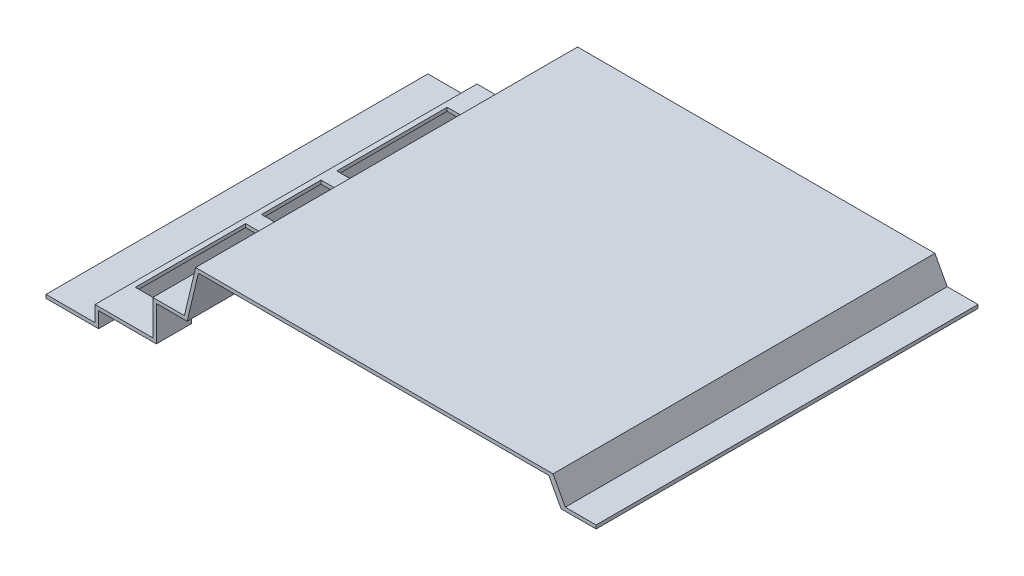
ISO-10303-21;
HEADER;
FILE_DESCRIPTION(('STEP AP214'),'2;1');
FILE_NAME('part.step','',(''),(''),'','','');
FILE_SCHEMA(('AUTOMOTIVE_DESIGN { 1 0 10303 214 1 1 1 1 }'));
ENDSEC;
DATA;
#1=APPLICATION_CONTEXT('core data for automotive mechanical design processes');
#2=APPLICATION_PROTOCOL_DEFINITION('international standard','automotive_design',2000,#1);
#3=PRODUCT_CONTEXT('',#1,'mechanical');
#4=PRODUCT('Part','Part','',(#3));
#5=PRODUCT_RELATED_PRODUCT_CATEGORY('part','',(#4));
#6=PRODUCT_DEFINITION_FORMATION('','',#4);
#7=PRODUCT_DEFINITION_CONTEXT('part definition',#1,'design');
#8=PRODUCT_DEFINITION('design','',#6,#7);
#9=PRODUCT_DEFINITION_SHAPE('','',#8);
#10=(LENGTH_UNIT() NAMED_UNIT(*) SI_UNIT(.MILLI.,.METRE.));
#11=(NAMED_UNIT(*) PLANE_ANGLE_UNIT() SI_UNIT($,.RADIAN.));
#12=(NAMED_UNIT(*) SI_UNIT($,.STERADIAN.) SOLID_ANGLE_UNIT());
#13=UNCERTAINTY_MEASURE_WITH_UNIT(LENGTH_MEASURE(1.E-05),#10,'distance_accuracy_value','');
#14=(GEOMETRIC_REPRESENTATION_CONTEXT(3) GLOBAL_UNCERTAINTY_ASSIGNED_CONTEXT((#13)) GLOBAL_UNIT_ASSIGNED_CONTEXT((#10,
#11,#12)) REPRESENTATION_CONTEXT('',''));
#15=CARTESIAN_POINT('',(0.,0.,0.));
#16=DIRECTION('',(0.,0.,1.));
#17=DIRECTION('',(1.,0.,0.));
#18=AXIS2_PLACEMENT_3D('',#15,#16,#17);
#19=CARTESIAN_POINT('',(63.,29.,109.));
#20=DIRECTION('',(-1.,0.,0.));
#21=DIRECTION('',(0.,0.,1.));
#22=AXIS2_PLACEMENT_3D('',#19,#20,#21);
#23=PLANE('',#22);
#24=DIRECTION('',(0.,0.,-1.));
#25=VECTOR('',#24,1.);
#26=CARTESIAN_POINT('',(63.,29.,109.));
#27=LINE('',#26,#25);
#28=CARTESIAN_POINT('',(63.,29.,-89.));
#29=VERTEX_POINT('',#28);
#30=CARTESIAN_POINT('',(63.,29.,-109.));
#31=VERTEX_POINT('',#30);
#32=EDGE_CURVE('E514',#29,#31,#27,.T.);
#33=ORIENTED_EDGE('',*,*,#32,.F.);
#34=DIRECTION('',(0.,-1.,0.));
#35=VECTOR('',#34,1.);
#36=CARTESIAN_POINT('',(63.,29.,-89.));
#37=LINE('',#36,#35);
#38=CARTESIAN_POINT('',(63.,8.99999999999999,-89.));
#39=VERTEX_POINT('',#38);
#40=EDGE_CURVE('E538',#29,#39,#37,.T.);
#41=ORIENTED_EDGE('',*,*,#40,.T.);
#42=DIRECTION('',(0.,0.,-1.));
#43=VECTOR('',#42,1.);
#44=CARTESIAN_POINT('',(63.,9.,109.));
#45=LINE('',#44,#43);
#46=CARTESIAN_POINT('',(63.,9.,-109.));
#47=VERTEX_POINT('',#46);
#48=EDGE_CURVE('E518',#39,#47,#45,.T.);
#49=ORIENTED_EDGE('',*,*,#48,.T.);
#50=DIRECTION('',(0.,1.,0.));
#51=VECTOR('',#50,1.);
#52=CARTESIAN_POINT('',(63.,29.,-109.));
#53=LINE('',#52,#51);
#54=EDGE_CURVE('E430',#47,#31,#53,.T.);
#55=ORIENTED_EDGE('',*,*,#54,.T.);
#56=EDGE_LOOP('',(#33,#41,#49,#55));
#57=FACE_BOUND('',#56,.T.);
#58=ADVANCED_FACE('F36',(#57),#23,.F.);
#59=CARTESIAN_POINT('',(63.,9.,109.));
#60=VERTEX_POINT('',#59);
#61=CARTESIAN_POINT('',(63.,8.99999999999999,89.));
#62=VERTEX_POINT('',#61);
#63=EDGE_CURVE('E520',#60,#62,#45,.T.);
#64=ORIENTED_EDGE('',*,*,#63,.T.);
#65=DIRECTION('',(0.,1.,0.));
#66=VECTOR('',#65,1.);
#67=CARTESIAN_POINT('',(63.,29.,89.));
#68=LINE('',#67,#66);
#69=CARTESIAN_POINT('',(63.,29.,89.));
#70=VERTEX_POINT('',#69);
#71=EDGE_CURVE('E576',#62,#70,#68,.T.);
#72=ORIENTED_EDGE('',*,*,#71,.T.);
#73=CARTESIAN_POINT('',(63.,29.,109.));
#74=VERTEX_POINT('',#73);
#75=EDGE_CURVE('E515',#74,#70,#27,.T.);
#76=ORIENTED_EDGE('',*,*,#75,.F.);
#77=DIRECTION('',(0.,1.,0.));
#78=VECTOR('',#77,1.);
#79=CARTESIAN_POINT('',(63.,29.,109.));
#80=LINE('',#79,#78);
#81=EDGE_CURVE('E388',#60,#74,#80,.T.);
#82=ORIENTED_EDGE('',*,*,#81,.F.);
#83=EDGE_LOOP('',(#64,#72,#76,#82));
#84=FACE_BOUND('',#83,.T.);
#85=ADVANCED_FACE('F583',(#84),#23,.F.);
#86=CARTESIAN_POINT('',(30.,0.,109.));
#87=DIRECTION('',(0.,1.,0.));
#88=DIRECTION('',(-1.,0.,0.));
#89=AXIS2_PLACEMENT_3D('',#86,#87,#88);
#90=PLANE('',#89);
#91=DIRECTION('',(1.,0.,0.));
#92=VECTOR('',#91,1.);
#93=CARTESIAN_POINT('',(30.,0.,-109.));
#94=LINE('',#93,#92);
#95=CARTESIAN_POINT('',(0.,0.,-109.));
#96=VERTEX_POINT('',#95);
#97=CARTESIAN_POINT('',(30.,0.,-109.));
#98=VERTEX_POINT('',#97);
#99=EDGE_CURVE('E312',#96,#98,#94,.T.);
#100=ORIENTED_EDGE('',*,*,#99,.T.);
#101=DIRECTION('',(0.,0.,-1.));
#102=VECTOR('',#101,1.);
#103=CARTESIAN_POINT('',(30.,0.,109.));
#104=LINE('',#103,#102);
#105=CARTESIAN_POINT('',(30.,0.,109.));
#106=VERTEX_POINT('',#105);
#107=EDGE_CURVE('E11',#106,#98,#104,.T.);
#108=ORIENTED_EDGE('',*,*,#107,.F.);
#109=DIRECTION('',(1.,0.,0.));
#110=VECTOR('',#109,1.);
#111=CARTESIAN_POINT('',(30.,0.,109.));
#112=LINE('',#111,#110);
#113=CARTESIAN_POINT('',(0.,0.,109.));
#114=VERTEX_POINT('',#113);
#115=EDGE_CURVE('E380',#114,#106,#112,.T.);
#116=ORIENTED_EDGE('',*,*,#115,.F.);
#117=DIRECTION('',(0.,0.,-1.));
#118=VECTOR('',#117,1.);
#119=CARTESIAN_POINT('',(0.,0.,109.));
#120=LINE('',#119,#118);
#121=EDGE_CURVE('E422',#114,#96,#120,.T.);
#122=ORIENTED_EDGE('',*,*,#121,.T.);
#123=EDGE_LOOP('',(#100,#108,#116,#122));
#124=FACE_BOUND('',#123,.T.);
#125=ADVANCED_FACE('F38',(#124),#90,.F.);
#126=CARTESIAN_POINT('',(30.,8.99999999999999,109.));
#127=DIRECTION('',(-1.,0.,0.));
#128=DIRECTION('',(0.,-1.,0.));
#129=AXIS2_PLACEMENT_3D('',#126,#127,#128);
#130=PLANE('',#129);
#131=DIRECTION('',(0.,1.,0.));
#132=VECTOR('',#131,1.);
#133=CARTESIAN_POINT('',(30.,8.99999999999999,-109.));
#134=LINE('',#133,#132);
#135=CARTESIAN_POINT('',(30.,8.99999999999999,-109.));
#136=VERTEX_POINT('',#135);
#137=EDGE_CURVE('E425',#98,#136,#134,.T.);
#138=ORIENTED_EDGE('',*,*,#137,.T.);
#139=DIRECTION('',(0.,0.,-1.));
#140=VECTOR('',#139,1.);
#141=CARTESIAN_POINT('',(30.,8.99999999999999,109.));
#142=LINE('',#141,#140);
#143=CARTESIAN_POINT('',(30.,8.99999999999999,109.));
#144=VERTEX_POINT('',#143);
#145=EDGE_CURVE('E44',#144,#136,#142,.T.);
#146=ORIENTED_EDGE('',*,*,#145,.F.);
#147=DIRECTION('',(0.,1.,0.));
#148=VECTOR('',#147,1.);
#149=CARTESIAN_POINT('',(30.,8.99999999999999,109.));
#150=LINE('',#149,#148);
#151=EDGE_CURVE('E383',#106,#144,#150,.T.);
#152=ORIENTED_EDGE('',*,*,#151,.F.);
#153=ORIENTED_EDGE('',*,*,#107,.T.);
#154=EDGE_LOOP('',(#138,#146,#152,#153));
#155=FACE_BOUND('',#154,.T.);
#156=ADVANCED_FACE('F590',(#155),#130,.F.);
#157=CARTESIAN_POINT('',(63.,9.,109.));
#158=DIRECTION('',(0.,1.,0.));
#159=DIRECTION('',(-1.,0.,0.));
#160=AXIS2_PLACEMENT_3D('',#157,#158,#159);
#161=PLANE('',#160);
#162=ORIENTED_EDGE('',*,*,#48,.F.);
#163=DIRECTION('',(1.,0.,0.));
#164=VECTOR('',#163,1.);
#165=CARTESIAN_POINT('',(61.,8.99999999999999,-89.));
#166=LINE('',#165,#164);
#167=CARTESIAN_POINT('',(31.,8.99999999999999,-89.));
#168=VERTEX_POINT('',#167);
#169=EDGE_CURVE('E310',#168,#39,#166,.T.);
#170=ORIENTED_EDGE('',*,*,#169,.F.);
#171=DIRECTION('',(0.,0.,-1.));
#172=VECTOR('',#171,1.);
#173=CARTESIAN_POINT('',(31.,8.99999999999999,-89.));
#174=LINE('',#173,#172);
#175=CARTESIAN_POINT('',(31.,8.99999999999999,-26.));
#176=VERTEX_POINT('',#175);
#177=EDGE_CURVE('E314',#176,#168,#174,.T.);
#178=ORIENTED_EDGE('',*,*,#177,.F.);
#179=DIRECTION('',(-1.,0.,0.));
#180=VECTOR('',#179,1.);
#181=CARTESIAN_POINT('',(61.,8.99999999999999,-26.));
#182=LINE('',#181,#180);
#183=CARTESIAN_POINT('',(61.,8.99999999999999,-26.));
#184=VERTEX_POINT('',#183);
#185=EDGE_CURVE('E309',#184,#176,#182,.T.);
#186=ORIENTED_EDGE('',*,*,#185,.F.);
#187=DIRECTION('',(0.,0.,1.));
#188=VECTOR('',#187,1.);
#189=CARTESIAN_POINT('',(61.,8.99999999999999,-89.));
#190=LINE('',#189,#188);
#191=CARTESIAN_POINT('',(61.,8.99999999999999,-61.));
#192=VERTEX_POINT('',#191);
#193=EDGE_CURVE('E298',#192,#184,#190,.T.);
#194=ORIENTED_EDGE('',*,*,#193,.F.);
#195=DIRECTION('',(-1.,0.,0.));
#196=VECTOR('',#195,1.);
#197=CARTESIAN_POINT('',(64.,8.99999999999999,-61.));
#198=LINE('',#197,#196);
#199=CARTESIAN_POINT('',(63.,8.99999999999999,-61.));
#200=VERTEX_POINT('',#199);
#201=EDGE_CURVE('E281',#200,#192,#198,.T.);
#202=ORIENTED_EDGE('',*,*,#201,.F.);
#203=CARTESIAN_POINT('',(63.,8.99999999999999,61.));
#204=VERTEX_POINT('',#203);
#205=EDGE_CURVE('E522',#204,#200,#45,.T.);
#206=ORIENTED_EDGE('',*,*,#205,.F.);
#207=DIRECTION('',(-1.,0.,0.));
#208=VECTOR('',#207,1.);
#209=CARTESIAN_POINT('',(64.,8.99999999999999,61.));
#210=LINE('',#209,#208);
#211=CARTESIAN_POINT('',(61.,8.99999999999999,61.));
#212=VERTEX_POINT('',#211);
#213=EDGE_CURVE('E548',#204,#212,#210,.T.);
#214=ORIENTED_EDGE('',*,*,#213,.T.);
#215=DIRECTION('',(0.,0.,1.));
#216=VECTOR('',#215,1.);
#217=CARTESIAN_POINT('',(61.,8.99999999999999,26.));
#218=LINE('',#217,#216);
#219=CARTESIAN_POINT('',(61.,8.99999999999999,26.));
#220=VERTEX_POINT('',#219);
#221=EDGE_CURVE('E361',#220,#212,#218,.T.);
#222=ORIENTED_EDGE('',*,*,#221,.F.);
#223=DIRECTION('',(1.,0.,0.));
#224=VECTOR('',#223,1.);
#225=CARTESIAN_POINT('',(61.,8.99999999999999,26.));
#226=LINE('',#225,#224);
#227=CARTESIAN_POINT('',(31.,8.99999999999999,26.));
#228=VERTEX_POINT('',#227);
#229=EDGE_CURVE('E342',#228,#220,#226,.T.);
#230=ORIENTED_EDGE('',*,*,#229,.F.);
#231=DIRECTION('',(0.,0.,-1.));
#232=VECTOR('',#231,1.);
#233=CARTESIAN_POINT('',(31.,8.99999999999999,26.));
#234=LINE('',#233,#232);
#235=CARTESIAN_POINT('',(31.,8.99999999999999,89.));
#236=VERTEX_POINT('',#235);
#237=EDGE_CURVE('E355',#236,#228,#234,.T.);
#238=ORIENTED_EDGE('',*,*,#237,.F.);
#239=DIRECTION('',(-1.,0.,0.));
#240=VECTOR('',#239,1.);
#241=CARTESIAN_POINT('',(61.,8.99999999999999,89.));
#242=LINE('',#241,#240);
#243=EDGE_CURVE('E358',#62,#236,#242,.T.);
#244=ORIENTED_EDGE('',*,*,#243,.F.);
#245=ORIENTED_EDGE('',*,*,#63,.F.);
#246=DIRECTION('',(1.,0.,0.));
#247=VECTOR('',#246,1.);
#248=CARTESIAN_POINT('',(63.,9.,109.));
#249=LINE('',#248,#247);
#250=EDGE_CURVE('E386',#144,#60,#249,.T.);
#251=ORIENTED_EDGE('',*,*,#250,.F.);
#252=ORIENTED_EDGE('',*,*,#145,.T.);
#253=DIRECTION('',(1.,0.,0.));
#254=VECTOR('',#253,1.);
#255=CARTESIAN_POINT('',(63.,9.,-109.));
#256=LINE('',#255,#254);
#257=EDGE_CURVE('E427',#136,#47,#256,.T.);
#258=ORIENTED_EDGE('',*,*,#257,.T.);
#259=EDGE_LOOP('',(#162,#170,#178,#186,#194,#202,#206,#214,#222,#230,#238,#244,#245,#251,#252,#258));
#260=FACE_BOUND('',#259,.T.);
#261=DIRECTION('',(-1.,0.,0.));
#262=VECTOR('',#261,1.);
#263=CARTESIAN_POINT('',(61.,8.99999999999999,17.));
#264=LINE('',#263,#262);
#265=CARTESIAN_POINT('',(61.,8.99999999999999,17.));
#266=VERTEX_POINT('',#265);
#267=CARTESIAN_POINT('',(31.,8.99999999999999,17.));
#268=VERTEX_POINT('',#267);
#269=EDGE_CURVE('E334',#266,#268,#264,.T.);
#270=ORIENTED_EDGE('',*,*,#269,.F.);
#271=DIRECTION('',(0.,0.,1.));
#272=VECTOR('',#271,1.);
#273=CARTESIAN_POINT('',(61.,8.99999999999999,-17.));
#274=LINE('',#273,#272);
#275=CARTESIAN_POINT('',(61.,8.99999999999999,-17.));
#276=VERTEX_POINT('',#275);
#277=EDGE_CURVE('E337',#276,#266,#274,.T.);
#278=ORIENTED_EDGE('',*,*,#277,.F.);
#279=DIRECTION('',(1.,0.,0.));
#280=VECTOR('',#279,1.);
#281=CARTESIAN_POINT('',(61.,8.99999999999999,-17.));
#282=LINE('',#281,#280);
#283=CARTESIAN_POINT('',(31.,8.99999999999999,-17.));
#284=VERTEX_POINT('',#283);
#285=EDGE_CURVE('E321',#284,#276,#282,.T.);
#286=ORIENTED_EDGE('',*,*,#285,.F.);
#287=DIRECTION('',(0.,0.,-1.));
#288=VECTOR('',#287,1.);
#289=CARTESIAN_POINT('',(31.,8.99999999999999,-17.));
#290=LINE('',#289,#288);
#291=EDGE_CURVE('E332',#268,#284,#290,.T.);
#292=ORIENTED_EDGE('',*,*,#291,.F.);
#293=EDGE_LOOP('',(#270,#278,#286,#292));
#294=FACE_BOUND('',#293,.T.);
#295=ADVANCED_FACE('F306',(#260,#294),#161,.F.);
#296=ORIENTED_EDGE('',*,*,#205,.T.);
#297=DIRECTION('',(0.,1.,0.));
#298=VECTOR('',#297,1.);
#299=CARTESIAN_POINT('',(63.,29.,-61.));
#300=LINE('',#299,#298);
#301=CARTESIAN_POINT('',(63.,29.,-61.));
#302=VERTEX_POINT('',#301);
#303=EDGE_CURVE('E287',#200,#302,#300,.T.);
#304=ORIENTED_EDGE('',*,*,#303,.T.);
#305=CARTESIAN_POINT('',(63.,29.,61.));
#306=VERTEX_POINT('',#305);
#307=EDGE_CURVE('E519',#306,#302,#27,.T.);
#308=ORIENTED_EDGE('',*,*,#307,.F.);
#309=DIRECTION('',(0.,-1.,0.));
#310=VECTOR('',#309,1.);
#311=CARTESIAN_POINT('',(63.,29.,61.));
#312=LINE('',#311,#310);
#313=EDGE_CURVE('E545',#306,#204,#312,.T.);
#314=ORIENTED_EDGE('',*,*,#313,.T.);
#315=EDGE_LOOP('',(#296,#304,#308,#314));
#316=FACE_BOUND('',#315,.T.);
#317=ADVANCED_FACE('F542',(#316),#23,.F.);
#318=CARTESIAN_POINT('',(80.5802177962265,29.,109.));
#319=DIRECTION('',(0.,1.,0.));
#320=DIRECTION('',(-1.,0.,0.));
#321=AXIS2_PLACEMENT_3D('',#318,#319,#320);
#322=PLANE('',#321);
#323=ORIENTED_EDGE('',*,*,#307,.T.);
#324=DIRECTION('',(-1.,0.,0.));
#325=VECTOR('',#324,1.);
#326=CARTESIAN_POINT('',(64.,29.,-61.));
#327=LINE('',#326,#325);
#328=CARTESIAN_POINT('',(61.,29.,-61.));
#329=VERTEX_POINT('',#328);
#330=EDGE_CURVE('E292',#302,#329,#327,.T.);
#331=ORIENTED_EDGE('',*,*,#330,.T.);
#332=DIRECTION('',(0.,0.,-1.));
#333=VECTOR('',#332,1.);
#334=CARTESIAN_POINT('',(61.,29.,-89.));
#335=LINE('',#334,#333);
#336=CARTESIAN_POINT('',(61.,29.,-89.));
#337=VERTEX_POINT('',#336);
#338=EDGE_CURVE('E293',#329,#337,#335,.T.);
#339=ORIENTED_EDGE('',*,*,#338,.T.);
#340=DIRECTION('',(-1.,0.,0.));
#341=VECTOR('',#340,1.);
#342=CARTESIAN_POINT('',(64.,29.,-89.));
#343=LINE('',#342,#341);
#344=EDGE_CURVE('E669',#29,#337,#343,.T.);
#345=ORIENTED_EDGE('',*,*,#344,.F.);
#346=ORIENTED_EDGE('',*,*,#32,.T.);
#347=DIRECTION('',(1.,0.,0.));
#348=VECTOR('',#347,1.);
#349=CARTESIAN_POINT('',(80.5802177962265,29.,-109.));
#350=LINE('',#349,#348);
#351=CARTESIAN_POINT('',(80.5802177962265,29.,-109.));
#352=VERTEX_POINT('',#351);
#353=EDGE_CURVE('E433',#31,#352,#350,.T.);
#354=ORIENTED_EDGE('',*,*,#353,.T.);
#355=DIRECTION('',(0.,0.,-1.));
#356=VECTOR('',#355,1.);
#357=CARTESIAN_POINT('',(80.5802177962265,29.,109.));
#358=LINE('',#357,#356);
#359=CARTESIAN_POINT('',(80.5802177962265,29.,109.));
#360=VERTEX_POINT('',#359);
#361=EDGE_CURVE('E511',#360,#352,#358,.T.);
#362=ORIENTED_EDGE('',*,*,#361,.F.);
#363=DIRECTION('',(1.,0.,0.));
#364=VECTOR('',#363,1.);
#365=CARTESIAN_POINT('',(80.5802177962265,29.,109.));
#366=LINE('',#365,#364);
#367=EDGE_CURVE('E390',#74,#360,#366,.T.);
#368=ORIENTED_EDGE('',*,*,#367,.F.);
#369=ORIENTED_EDGE('',*,*,#75,.T.);
#370=DIRECTION('',(-1.,0.,0.));
#371=VECTOR('',#370,1.);
#372=CARTESIAN_POINT('',(64.,29.,89.));
#373=LINE('',#372,#371);
#374=CARTESIAN_POINT('',(61.,29.,89.));
#375=VERTEX_POINT('',#374);
#376=EDGE_CURVE('E579',#70,#375,#373,.T.);
#377=ORIENTED_EDGE('',*,*,#376,.T.);
#378=DIRECTION('',(0.,0.,-1.));
#379=VECTOR('',#378,1.);
#380=CARTESIAN_POINT('',(61.,29.,89.));
#381=LINE('',#380,#379);
#382=CARTESIAN_POINT('',(61.,29.,61.));
#383=VERTEX_POINT('',#382);
#384=EDGE_CURVE('E672',#375,#383,#381,.T.);
#385=ORIENTED_EDGE('',*,*,#384,.T.);
#386=DIRECTION('',(-1.,0.,0.));
#387=VECTOR('',#386,1.);
#388=CARTESIAN_POINT('',(64.,29.,61.));
#389=LINE('',#388,#387);
#390=EDGE_CURVE('E551',#306,#383,#389,.T.);
#391=ORIENTED_EDGE('',*,*,#390,.F.);
#392=EDGE_LOOP('',(#323,#331,#339,#345,#346,#354,#362,#368,#369,#377,#385,#391));
#393=FACE_BOUND('',#392,.T.);
#394=CARTESIAN_POINT('',(70.,29.,0.));
#395=DIRECTION('',(0.,1.,0.));
#396=DIRECTION('',(-1.,0.,0.));
#397=AXIS2_PLACEMENT_3D('',#394,#395,#396);
#398=CIRCLE('',#397,2.25);
#399=CARTESIAN_POINT('',(67.75,29.,0.));
#400=VERTEX_POINT('',#399);
#401=EDGE_CURVE('E368',#400,#400,#398,.T.);
#402=ORIENTED_EDGE('',*,*,#401,.T.);
#403=EDGE_LOOP('',(#402));
#404=FACE_BOUND('',#403,.T.);
#405=ADVANCED_FACE('F666',(#393,#404),#322,.F.);
#406=CARTESIAN_POINT('',(87.,56.,109.));
#407=DIRECTION('',(-0.972877527453005,0.23132080878496,0.));
#408=DIRECTION('',(-0.23132080878496,-0.972877527453005,0.));
#409=AXIS2_PLACEMENT_3D('',#406,#407,#408);
#410=PLANE('',#409);
#411=DIRECTION('',(0.23132080878496,0.972877527453005,0.));
#412=VECTOR('',#411,1.);
#413=CARTESIAN_POINT('',(87.,56.,-109.));
#414=LINE('',#413,#412);
#415=CARTESIAN_POINT('',(87.,56.,-109.));
#416=VERTEX_POINT('',#415);
#417=EDGE_CURVE('E435',#352,#416,#414,.T.);
#418=ORIENTED_EDGE('',*,*,#417,.T.);
#419=DIRECTION('',(0.,0.,-1.));
#420=VECTOR('',#419,1.);
#421=CARTESIAN_POINT('',(87.,56.,109.));
#422=LINE('',#421,#420);
#423=CARTESIAN_POINT('',(87.,56.,109.));
#424=VERTEX_POINT('',#423);
#425=EDGE_CURVE('E508',#424,#416,#422,.T.);
#426=ORIENTED_EDGE('',*,*,#425,.F.);
#427=DIRECTION('',(0.23132080878496,0.972877527453005,0.));
#428=VECTOR('',#427,1.);
#429=CARTESIAN_POINT('',(87.,56.,109.));
#430=LINE('',#429,#428);
#431=EDGE_CURVE('E392',#360,#424,#430,.T.);
#432=ORIENTED_EDGE('',*,*,#431,.F.);
#433=ORIENTED_EDGE('',*,*,#361,.T.);
#434=EDGE_LOOP('',(#418,#426,#432,#433));
#435=FACE_BOUND('',#434,.T.);
#436=ADVANCED_FACE('F664',(#435),#410,.F.);
#437=CARTESIAN_POINT('',(287.,56.,109.));
#438=DIRECTION('',(0.,1.,0.));
#439=DIRECTION('',(-1.,0.,0.));
#440=AXIS2_PLACEMENT_3D('',#437,#438,#439);
#441=PLANE('',#440);
#442=DIRECTION('',(1.,0.,0.));
#443=VECTOR('',#442,1.);
#444=CARTESIAN_POINT('',(287.,56.,-109.));
#445=LINE('',#444,#443);
#446=CARTESIAN_POINT('',(287.,56.,-109.));
#447=VERTEX_POINT('',#446);
#448=EDGE_CURVE('E437',#416,#447,#445,.T.);
#449=ORIENTED_EDGE('',*,*,#448,.T.);
#450=DIRECTION('',(0.,0.,-1.));
#451=VECTOR('',#450,1.);
#452=CARTESIAN_POINT('',(287.,56.,109.));
#453=LINE('',#452,#451);
#454=CARTESIAN_POINT('',(287.,56.,109.));
#455=VERTEX_POINT('',#454);
#456=EDGE_CURVE('E505',#455,#447,#453,.T.);
#457=ORIENTED_EDGE('',*,*,#456,.F.);
#458=DIRECTION('',(1.,0.,0.));
#459=VECTOR('',#458,1.);
#460=CARTESIAN_POINT('',(287.,56.,109.));
#461=LINE('',#460,#459);
#462=EDGE_CURVE('E394',#424,#455,#461,.T.);
#463=ORIENTED_EDGE('',*,*,#462,.F.);
#464=ORIENTED_EDGE('',*,*,#425,.T.);
#465=EDGE_LOOP('',(#449,#457,#463,#464));
#466=FACE_BOUND('',#465,.T.);
#467=ADVANCED_FACE('F660',(#466),#441,.F.);
#468=CARTESIAN_POINT('',(294.,43.,109.));
#469=DIRECTION('',(0.880471099922175,0.474099823035018,0.));
#470=DIRECTION('',(-0.474099823035018,0.880471099922175,0.));
#471=AXIS2_PLACEMENT_3D('',#468,#469,#470);
#472=PLANE('',#471);
#473=DIRECTION('',(0.474099823035018,-0.880471099922175,0.));
#474=VECTOR('',#473,1.);
#475=CARTESIAN_POINT('',(294.,43.,-109.));
#476=LINE('',#475,#474);
#477=CARTESIAN_POINT('',(294.,43.,-109.));
#478=VERTEX_POINT('',#477);
#479=EDGE_CURVE('E439',#447,#478,#476,.T.);
#480=ORIENTED_EDGE('',*,*,#479,.T.);
#481=DIRECTION('',(0.,0.,-1.));
#482=VECTOR('',#481,1.);
#483=CARTESIAN_POINT('',(294.,43.,109.));
#484=LINE('',#483,#482);
#485=CARTESIAN_POINT('',(294.,43.,109.));
#486=VERTEX_POINT('',#485);
#487=EDGE_CURVE('E502',#486,#478,#484,.T.);
#488=ORIENTED_EDGE('',*,*,#487,.F.);
#489=DIRECTION('',(0.474099823035018,-0.880471099922175,0.));
#490=VECTOR('',#489,1.);
#491=CARTESIAN_POINT('',(294.,43.,109.));
#492=LINE('',#491,#490);
#493=EDGE_CURVE('E396',#455,#486,#492,.T.);
#494=ORIENTED_EDGE('',*,*,#493,.F.);
#495=ORIENTED_EDGE('',*,*,#456,.T.);
#496=EDGE_LOOP('',(#480,#488,#494,#495));
#497=FACE_BOUND('',#496,.T.);
#498=ADVANCED_FACE('F655',(#497),#472,.F.);
#499=CARTESIAN_POINT('',(314.,43.,109.));
#500=DIRECTION('',(0.,1.,0.));
#501=DIRECTION('',(0.,0.,1.));
#502=AXIS2_PLACEMENT_3D('',#499,#500,#501);
#503=PLANE('',#502);
#504=DIRECTION('',(1.,0.,0.));
#505=VECTOR('',#504,1.);
#506=CARTESIAN_POINT('',(314.,43.,-109.));
#507=LINE('',#506,#505);
#508=CARTESIAN_POINT('',(314.,43.,-109.));
#509=VERTEX_POINT('',#508);
#510=EDGE_CURVE('E441',#478,#509,#507,.T.);
#511=ORIENTED_EDGE('',*,*,#510,.T.);
#512=DIRECTION('',(0.,0.,-1.));
#513=VECTOR('',#512,1.);
#514=CARTESIAN_POINT('',(314.,43.,109.));
#515=LINE('',#514,#513);
#516=CARTESIAN_POINT('',(314.,43.,109.));
#517=VERTEX_POINT('',#516);
#518=EDGE_CURVE('E499',#517,#509,#515,.T.);
#519=ORIENTED_EDGE('',*,*,#518,.F.);
#520=DIRECTION('',(1.,0.,0.));
#521=VECTOR('',#520,1.);
#522=CARTESIAN_POINT('',(314.,43.,109.));
#523=LINE('',#522,#521);
#524=EDGE_CURVE('E398',#486,#517,#523,.T.);
#525=ORIENTED_EDGE('',*,*,#524,.F.);
#526=ORIENTED_EDGE('',*,*,#487,.T.);
#527=EDGE_LOOP('',(#511,#519,#525,#526));
#528=FACE_BOUND('',#527,.T.);
#529=ADVANCED_FACE('F650',(#528),#503,.F.);
#530=CARTESIAN_POINT('',(314.,45.,109.));
#531=DIRECTION('',(-1.,0.,0.));
#532=DIRECTION('',(0.,-1.,0.));
#533=AXIS2_PLACEMENT_3D('',#530,#531,#532);
#534=PLANE('',#533);
#535=DIRECTION('',(0.,1.,0.));
#536=VECTOR('',#535,1.);
#537=CARTESIAN_POINT('',(314.,45.,-109.));
#538=LINE('',#537,#536);
#539=CARTESIAN_POINT('',(314.,45.,-109.));
#540=VERTEX_POINT('',#539);
#541=EDGE_CURVE('E443',#509,#540,#538,.T.);
#542=ORIENTED_EDGE('',*,*,#541,.T.);
#543=DIRECTION('',(0.,0.,-1.));
#544=VECTOR('',#543,1.);
#545=CARTESIAN_POINT('',(314.,45.,109.));
#546=LINE('',#545,#544);
#547=CARTESIAN_POINT('',(314.,45.,109.));
#548=VERTEX_POINT('',#547);
#549=EDGE_CURVE('E496',#548,#540,#546,.T.);
#550=ORIENTED_EDGE('',*,*,#549,.F.);
#551=DIRECTION('',(0.,1.,0.));
#552=VECTOR('',#551,1.);
#553=CARTESIAN_POINT('',(314.,45.,109.));
#554=LINE('',#553,#552);
#555=EDGE_CURVE('E400',#517,#548,#554,.T.);
#556=ORIENTED_EDGE('',*,*,#555,.F.);
#557=ORIENTED_EDGE('',*,*,#518,.T.);
#558=EDGE_LOOP('',(#542,#550,#556,#557));
#559=FACE_BOUND('',#558,.T.);
#560=ADVANCED_FACE('F646',(#559),#534,.F.);
#561=CARTESIAN_POINT('',(296.419782203774,45.,109.));
#562=DIRECTION('',(0.,-1.,0.));
#563=DIRECTION('',(1.,0.,0.));
#564=AXIS2_PLACEMENT_3D('',#561,#562,#563);
#565=PLANE('',#564);
#566=DIRECTION('',(-1.,0.,0.));
#567=VECTOR('',#566,1.);
#568=CARTESIAN_POINT('',(296.419782203774,45.,-109.));
#569=LINE('',#568,#567);
#570=CARTESIAN_POINT('',(296.419782203774,45.,-109.));
#571=VERTEX_POINT('',#570);
#572=EDGE_CURVE('E445',#540,#571,#569,.T.);
#573=ORIENTED_EDGE('',*,*,#572,.T.);
#574=DIRECTION('',(0.,0.,-1.));
#575=VECTOR('',#574,1.);
#576=CARTESIAN_POINT('',(296.419782203774,45.,109.));
#577=LINE('',#576,#575);
#578=CARTESIAN_POINT('',(296.419782203774,45.,109.));
#579=VERTEX_POINT('',#578);
#580=EDGE_CURVE('E493',#579,#571,#577,.T.);
#581=ORIENTED_EDGE('',*,*,#580,.F.);
#582=DIRECTION('',(-1.,0.,0.));
#583=VECTOR('',#582,1.);
#584=CARTESIAN_POINT('',(296.419782203774,45.,109.));
#585=LINE('',#584,#583);
#586=EDGE_CURVE('E402',#548,#579,#585,.T.);
#587=ORIENTED_EDGE('',*,*,#586,.F.);
#588=ORIENTED_EDGE('',*,*,#549,.T.);
#589=EDGE_LOOP('',(#573,#581,#587,#588));
#590=FACE_BOUND('',#589,.T.);
#591=ADVANCED_FACE('F641',(#590),#565,.F.);
#592=CARTESIAN_POINT('',(289.419782203774,58.,109.));
#593=DIRECTION('',(-0.880471099922175,-0.474099823035018,0.));
#594=DIRECTION('',(0.474099823035018,-0.880471099922175,0.));
#595=AXIS2_PLACEMENT_3D('',#592,#593,#594);
#596=PLANE('',#595);
#597=DIRECTION('',(-0.474099823035018,0.880471099922175,0.));
#598=VECTOR('',#597,1.);
#599=CARTESIAN_POINT('',(289.419782203774,58.,-109.));
#600=LINE('',#599,#598);
#601=CARTESIAN_POINT('',(289.419782203774,58.,-109.));
#602=VERTEX_POINT('',#601);
#603=EDGE_CURVE('E447',#571,#602,#600,.T.);
#604=ORIENTED_EDGE('',*,*,#603,.T.);
#605=DIRECTION('',(0.,0.,-1.));
#606=VECTOR('',#605,1.);
#607=CARTESIAN_POINT('',(289.419782203774,58.,109.));
#608=LINE('',#607,#606);
#609=CARTESIAN_POINT('',(289.419782203774,58.,109.));
#610=VERTEX_POINT('',#609);
#611=EDGE_CURVE('E490',#610,#602,#608,.T.);
#612=ORIENTED_EDGE('',*,*,#611,.F.);
#613=DIRECTION('',(-0.474099823035018,0.880471099922175,0.));
#614=VECTOR('',#613,1.);
#615=CARTESIAN_POINT('',(289.419782203774,58.,109.));
#616=LINE('',#615,#614);
#617=EDGE_CURVE('E404',#579,#610,#616,.T.);
#618=ORIENTED_EDGE('',*,*,#617,.F.);
#619=ORIENTED_EDGE('',*,*,#580,.T.);
#620=EDGE_LOOP('',(#604,#612,#618,#619));
#621=FACE_BOUND('',#620,.T.);
#622=ADVANCED_FACE('F635',(#621),#596,.F.);
#623=CARTESIAN_POINT('',(85.4197822037735,58.,109.));
#624=DIRECTION('',(0.,-1.,0.));
#625=DIRECTION('',(0.,0.,-1.));
#626=AXIS2_PLACEMENT_3D('',#623,#624,#625);
#627=PLANE('',#626);
#628=DIRECTION('',(-1.,0.,0.));
#629=VECTOR('',#628,1.);
#630=CARTESIAN_POINT('',(85.4197822037735,58.,-109.));
#631=LINE('',#630,#629);
#632=CARTESIAN_POINT('',(85.4197822037735,58.,-109.));
#633=VERTEX_POINT('',#632);
#634=EDGE_CURVE('E449',#602,#633,#631,.T.);
#635=ORIENTED_EDGE('',*,*,#634,.T.);
#636=DIRECTION('',(0.,0.,-1.));
#637=VECTOR('',#636,1.);
#638=CARTESIAN_POINT('',(85.4197822037735,58.,109.));
#639=LINE('',#638,#637);
#640=CARTESIAN_POINT('',(85.4197822037735,58.,109.));
#641=VERTEX_POINT('',#640);
#642=EDGE_CURVE('E487',#641,#633,#639,.T.);
#643=ORIENTED_EDGE('',*,*,#642,.F.);
#644=DIRECTION('',(-1.,0.,0.));
#645=VECTOR('',#644,1.);
#646=CARTESIAN_POINT('',(85.4197822037735,58.,109.));
#647=LINE('',#646,#645);
#648=EDGE_CURVE('E406',#610,#641,#647,.T.);
#649=ORIENTED_EDGE('',*,*,#648,.F.);
#650=ORIENTED_EDGE('',*,*,#611,.T.);
#651=EDGE_LOOP('',(#635,#643,#649,#650));
#652=FACE_BOUND('',#651,.T.);
#653=ADVANCED_FACE('F631',(#652),#627,.F.);
#654=CARTESIAN_POINT('',(79.,31.,109.));
#655=DIRECTION('',(0.972877527453004,-0.231320808784961,0.));
#656=DIRECTION('',(0.231320808784961,0.972877527453004,0.));
#657=AXIS2_PLACEMENT_3D('',#654,#655,#656);
#658=PLANE('',#657);
#659=DIRECTION('',(-0.231320808784961,-0.972877527453004,0.));
#660=VECTOR('',#659,1.);
#661=CARTESIAN_POINT('',(79.,31.,-109.));
#662=LINE('',#661,#660);
#663=CARTESIAN_POINT('',(79.,31.,-109.));
#664=VERTEX_POINT('',#663);
#665=EDGE_CURVE('E451',#633,#664,#662,.T.);
#666=ORIENTED_EDGE('',*,*,#665,.T.);
#667=DIRECTION('',(0.,0.,-1.));
#668=VECTOR('',#667,1.);
#669=CARTESIAN_POINT('',(79.,31.,109.));
#670=LINE('',#669,#668);
#671=CARTESIAN_POINT('',(79.,31.,109.));
#672=VERTEX_POINT('',#671);
#673=EDGE_CURVE('E484',#672,#664,#670,.T.);
#674=ORIENTED_EDGE('',*,*,#673,.F.);
#675=DIRECTION('',(-0.231320808784961,-0.972877527453004,0.));
#676=VECTOR('',#675,1.);
#677=CARTESIAN_POINT('',(79.,31.,109.));
#678=LINE('',#677,#676);
#679=EDGE_CURVE('E408',#641,#672,#678,.T.);
#680=ORIENTED_EDGE('',*,*,#679,.F.);
#681=ORIENTED_EDGE('',*,*,#642,.T.);
#682=EDGE_LOOP('',(#666,#674,#680,#681));
#683=FACE_BOUND('',#682,.T.);
#684=ADVANCED_FACE('F626',(#683),#658,.F.);
#685=CARTESIAN_POINT('',(61.,31.,109.));
#686=DIRECTION('',(0.,-1.,0.));
#687=DIRECTION('',(0.,0.,-1.));
#688=AXIS2_PLACEMENT_3D('',#685,#686,#687);
#689=PLANE('',#688);
#690=CARTESIAN_POINT('',(70.,31.,0.));
#691=DIRECTION('',(0.,1.,0.));
#692=DIRECTION('',(0.,0.,1.));
#693=AXIS2_PLACEMENT_3D('',#690,#691,#692);
#694=CIRCLE('',#693,2.25);
#695=CARTESIAN_POINT('',(70.,31.,2.25));
#696=VERTEX_POINT('',#695);
#697=EDGE_CURVE('E680',#696,#696,#694,.T.);
#698=ORIENTED_EDGE('',*,*,#697,.F.);
#699=EDGE_LOOP('',(#698));
#700=FACE_BOUND('',#699,.T.);
#701=DIRECTION('',(-1.,0.,0.));
#702=VECTOR('',#701,1.);
#703=CARTESIAN_POINT('',(61.,31.,-109.));
#704=LINE('',#703,#702);
#705=CARTESIAN_POINT('',(61.,31.,-109.));
#706=VERTEX_POINT('',#705);
#707=EDGE_CURVE('E453',#664,#706,#704,.T.);
#708=ORIENTED_EDGE('',*,*,#707,.T.);
#709=DIRECTION('',(0.,0.,-1.));
#710=VECTOR('',#709,1.);
#711=CARTESIAN_POINT('',(61.,31.,109.));
#712=LINE('',#711,#710);
#713=CARTESIAN_POINT('',(61.,31.,109.));
#714=VERTEX_POINT('',#713);
#715=EDGE_CURVE('E480',#714,#706,#712,.T.);
#716=ORIENTED_EDGE('',*,*,#715,.F.);
#717=DIRECTION('',(-1.,0.,0.));
#718=VECTOR('',#717,1.);
#719=CARTESIAN_POINT('',(61.,31.,109.));
#720=LINE('',#719,#718);
#721=EDGE_CURVE('E410',#672,#714,#720,.T.);
#722=ORIENTED_EDGE('',*,*,#721,.F.);
#723=ORIENTED_EDGE('',*,*,#673,.T.);
#724=EDGE_LOOP('',(#708,#716,#722,#723));
#725=FACE_BOUND('',#724,.T.);
#726=ADVANCED_FACE('F620',(#700,#725),#689,.F.);
#727=CARTESIAN_POINT('',(61.,11.,109.));
#728=DIRECTION('',(1.,0.,0.));
#729=DIRECTION('',(0.,0.,-1.));
#730=AXIS2_PLACEMENT_3D('',#727,#728,#729);
#731=PLANE('',#730);
#732=DIRECTION('',(0.,0.,-1.));
#733=VECTOR('',#732,1.);
#734=CARTESIAN_POINT('',(61.,11.,109.));
#735=LINE('',#734,#733);
#736=CARTESIAN_POINT('',(61.,11.,-89.));
#737=VERTEX_POINT('',#736);
#738=CARTESIAN_POINT('',(61.,11.,-109.));
#739=VERTEX_POINT('',#738);
#740=EDGE_CURVE('E476',#737,#739,#735,.T.);
#741=ORIENTED_EDGE('',*,*,#740,.F.);
#742=DIRECTION('',(0.,-1.,0.));
#743=VECTOR('',#742,1.);
#744=CARTESIAN_POINT('',(61.,8.99999999999999,-89.));
#745=LINE('',#744,#743);
#746=EDGE_CURVE('E302',#337,#737,#745,.T.);
#747=ORIENTED_EDGE('',*,*,#746,.F.);
#748=ORIENTED_EDGE('',*,*,#338,.F.);
#749=DIRECTION('',(0.,1.,0.));
#750=VECTOR('',#749,1.);
#751=CARTESIAN_POINT('',(61.,8.99999999999999,-61.));
#752=LINE('',#751,#750);
#753=EDGE_CURVE('E284',#192,#329,#752,.T.);
#754=ORIENTED_EDGE('',*,*,#753,.F.);
#755=ORIENTED_EDGE('',*,*,#193,.T.);
#756=DIRECTION('',(0.,1.,0.));
#757=VECTOR('',#756,1.);
#758=CARTESIAN_POINT('',(61.,-60.7782200976781,-26.));
#759=LINE('',#758,#757);
#760=CARTESIAN_POINT('',(61.,11.,-26.));
#761=VERTEX_POINT('',#760);
#762=EDGE_CURVE('E327',#184,#761,#759,.T.);
#763=ORIENTED_EDGE('',*,*,#762,.T.);
#764=CARTESIAN_POINT('',(61.,11.,-17.));
#765=VERTEX_POINT('',#764);
#766=EDGE_CURVE('E614',#765,#761,#735,.T.);
#767=ORIENTED_EDGE('',*,*,#766,.F.);
#768=DIRECTION('',(0.,1.,0.));
#769=VECTOR('',#768,1.);
#770=CARTESIAN_POINT('',(61.,-60.7782200976781,-17.));
#771=LINE('',#770,#769);
#772=EDGE_CURVE('E348',#276,#765,#771,.T.);
#773=ORIENTED_EDGE('',*,*,#772,.F.);
#774=ORIENTED_EDGE('',*,*,#277,.T.);
#775=DIRECTION('',(0.,1.,0.));
#776=VECTOR('',#775,1.);
#777=CARTESIAN_POINT('',(61.,-60.7782200976781,17.));
#778=LINE('',#777,#776);
#779=CARTESIAN_POINT('',(61.,11.,17.));
#780=VERTEX_POINT('',#779);
#781=EDGE_CURVE('E335',#266,#780,#778,.T.);
#782=ORIENTED_EDGE('',*,*,#781,.T.);
#783=CARTESIAN_POINT('',(61.,11.,26.));
#784=VERTEX_POINT('',#783);
#785=EDGE_CURVE('E481',#784,#780,#735,.T.);
#786=ORIENTED_EDGE('',*,*,#785,.F.);
#787=DIRECTION('',(0.,1.,0.));
#788=VECTOR('',#787,1.);
#789=CARTESIAN_POINT('',(61.,-60.7782200976781,26.));
#790=LINE('',#789,#788);
#791=EDGE_CURVE('E374',#220,#784,#790,.T.);
#792=ORIENTED_EDGE('',*,*,#791,.F.);
#793=ORIENTED_EDGE('',*,*,#221,.T.);
#794=DIRECTION('',(0.,-1.,0.));
#795=VECTOR('',#794,1.);
#796=CARTESIAN_POINT('',(61.,8.99999999999999,61.));
#797=LINE('',#796,#795);
#798=EDGE_CURVE('E556',#383,#212,#797,.T.);
#799=ORIENTED_EDGE('',*,*,#798,.F.);
#800=ORIENTED_EDGE('',*,*,#384,.F.);
#801=DIRECTION('',(0.,1.,0.));
#802=VECTOR('',#801,1.);
#803=CARTESIAN_POINT('',(61.,8.99999999999999,89.));
#804=LINE('',#803,#802);
#805=CARTESIAN_POINT('',(61.,11.,89.));
#806=VERTEX_POINT('',#805);
#807=EDGE_CURVE('E693',#806,#375,#804,.T.);
#808=ORIENTED_EDGE('',*,*,#807,.F.);
#809=CARTESIAN_POINT('',(61.,11.,109.));
#810=VERTEX_POINT('',#809);
#811=EDGE_CURVE('E477',#810,#806,#735,.T.);
#812=ORIENTED_EDGE('',*,*,#811,.F.);
#813=DIRECTION('',(0.,-1.,0.));
#814=VECTOR('',#813,1.);
#815=CARTESIAN_POINT('',(61.,11.,109.));
#816=LINE('',#815,#814);
#817=EDGE_CURVE('E412',#714,#810,#816,.T.);
#818=ORIENTED_EDGE('',*,*,#817,.F.);
#819=ORIENTED_EDGE('',*,*,#715,.T.);
#820=DIRECTION('',(0.,-1.,0.));
#821=VECTOR('',#820,1.);
#822=CARTESIAN_POINT('',(61.,11.,-109.));
#823=LINE('',#822,#821);
#824=EDGE_CURVE('E455',#706,#739,#823,.T.);
#825=ORIENTED_EDGE('',*,*,#824,.T.);
#826=EDGE_LOOP('',(#741,#747,#748,#754,#755,#763,#767,#773,#774,#782,#786,#792,#793,#799,#800,
#808,#812,#818,#819,#825));
#827=FACE_BOUND('',#826,.T.);
#828=ADVANCED_FACE('F297',(#827),#731,.F.);
#829=CARTESIAN_POINT('',(28.,11.,109.));
#830=DIRECTION('',(0.,-1.,0.));
#831=DIRECTION('',(0.,0.,-1.));
#832=AXIS2_PLACEMENT_3D('',#829,#830,#831);
#833=PLANE('',#832);
#834=ORIENTED_EDGE('',*,*,#766,.T.);
#835=DIRECTION('',(1.,0.,0.));
#836=VECTOR('',#835,1.);
#837=CARTESIAN_POINT('',(61.,11.,-26.));
#838=LINE('',#837,#836);
#839=CARTESIAN_POINT('',(31.,11.,-26.));
#840=VERTEX_POINT('',#839);
#841=EDGE_CURVE('E324',#840,#761,#838,.T.);
#842=ORIENTED_EDGE('',*,*,#841,.F.);
#843=DIRECTION('',(0.,0.,1.));
#844=VECTOR('',#843,1.);
#845=CARTESIAN_POINT('',(31.,11.,-89.));
#846=LINE('',#845,#844);
#847=CARTESIAN_POINT('',(31.,11.,-89.));
#848=VERTEX_POINT('',#847);
#849=EDGE_CURVE('E320',#848,#840,#846,.T.);
#850=ORIENTED_EDGE('',*,*,#849,.F.);
#851=DIRECTION('',(-1.,0.,0.));
#852=VECTOR('',#851,1.);
#853=CARTESIAN_POINT('',(61.,11.,-89.));
#854=LINE('',#853,#852);
#855=EDGE_CURVE('E318',#737,#848,#854,.T.);
#856=ORIENTED_EDGE('',*,*,#855,.F.);
#857=ORIENTED_EDGE('',*,*,#740,.T.);
#858=DIRECTION('',(-1.,0.,0.));
#859=VECTOR('',#858,1.);
#860=CARTESIAN_POINT('',(28.,11.,-109.));
#861=LINE('',#860,#859);
#862=CARTESIAN_POINT('',(28.,11.,-109.));
#863=VERTEX_POINT('',#862);
#864=EDGE_CURVE('E458',#739,#863,#861,.T.);
#865=ORIENTED_EDGE('',*,*,#864,.T.);
#866=DIRECTION('',(0.,0.,-1.));
#867=VECTOR('',#866,1.);
#868=CARTESIAN_POINT('',(28.,11.,109.));
#869=LINE('',#868,#867);
#870=CARTESIAN_POINT('',(28.,11.,109.));
#871=VERTEX_POINT('',#870);
#872=EDGE_CURVE('E473',#871,#863,#869,.T.);
#873=ORIENTED_EDGE('',*,*,#872,.F.);
#874=DIRECTION('',(-1.,0.,0.));
#875=VECTOR('',#874,1.);
#876=CARTESIAN_POINT('',(28.,11.,109.));
#877=LINE('',#876,#875);
#878=EDGE_CURVE('E414',#810,#871,#877,.T.);
#879=ORIENTED_EDGE('',*,*,#878,.F.);
#880=ORIENTED_EDGE('',*,*,#811,.T.);
#881=DIRECTION('',(1.,0.,0.));
#882=VECTOR('',#881,1.);
#883=CARTESIAN_POINT('',(61.,11.,89.));
#884=LINE('',#883,#882);
#885=CARTESIAN_POINT('',(31.,11.,89.));
#886=VERTEX_POINT('',#885);
#887=EDGE_CURVE('E371',#886,#806,#884,.T.);
#888=ORIENTED_EDGE('',*,*,#887,.F.);
#889=DIRECTION('',(0.,0.,1.));
#890=VECTOR('',#889,1.);
#891=CARTESIAN_POINT('',(31.,11.,26.));
#892=LINE('',#891,#890);
#893=CARTESIAN_POINT('',(31.,11.,26.));
#894=VERTEX_POINT('',#893);
#895=EDGE_CURVE('E367',#894,#886,#892,.T.);
#896=ORIENTED_EDGE('',*,*,#895,.F.);
#897=DIRECTION('',(-1.,0.,0.));
#898=VECTOR('',#897,1.);
#899=CARTESIAN_POINT('',(61.,11.,26.));
#900=LINE('',#899,#898);
#901=EDGE_CURVE('E364',#784,#894,#900,.T.);
#902=ORIENTED_EDGE('',*,*,#901,.F.);
#903=ORIENTED_EDGE('',*,*,#785,.T.);
#904=DIRECTION('',(1.,0.,0.));
#905=VECTOR('',#904,1.);
#906=CARTESIAN_POINT('',(61.,11.,17.));
#907=LINE('',#906,#905);
#908=CARTESIAN_POINT('',(31.,11.,17.));
#909=VERTEX_POINT('',#908);
#910=EDGE_CURVE('E345',#909,#780,#907,.T.);
#911=ORIENTED_EDGE('',*,*,#910,.F.);
#912=DIRECTION('',(0.,0.,1.));
#913=VECTOR('',#912,1.);
#914=CARTESIAN_POINT('',(31.,11.,-17.));
#915=LINE('',#914,#913);
#916=CARTESIAN_POINT('',(31.,11.,-17.));
#917=VERTEX_POINT('',#916);
#918=EDGE_CURVE('E341',#917,#909,#915,.T.);
#919=ORIENTED_EDGE('',*,*,#918,.F.);
#920=DIRECTION('',(-1.,0.,0.));
#921=VECTOR('',#920,1.);
#922=CARTESIAN_POINT('',(61.,11.,-17.));
#923=LINE('',#922,#921);
#924=EDGE_CURVE('E339',#765,#917,#923,.T.);
#925=ORIENTED_EDGE('',*,*,#924,.F.);
#926=EDGE_LOOP('',(#834,#842,#850,#856,#857,#865,#873,#879,#880,#888,#896,#902,#903,#911,#919,#925));
#927=FACE_BOUND('',#926,.T.);
#928=ADVANCED_FACE('F565',(#927),#833,.F.);
#929=CARTESIAN_POINT('',(28.,2.,109.));
#930=DIRECTION('',(1.,0.,0.));
#931=DIRECTION('',(0.,0.,-1.));
#932=AXIS2_PLACEMENT_3D('',#929,#930,#931);
#933=PLANE('',#932);
#934=DIRECTION('',(0.,-1.,0.));
#935=VECTOR('',#934,1.);
#936=CARTESIAN_POINT('',(28.,2.,-109.));
#937=LINE('',#936,#935);
#938=CARTESIAN_POINT('',(28.,2.,-109.));
#939=VERTEX_POINT('',#938);
#940=EDGE_CURVE('E460',#863,#939,#937,.T.);
#941=ORIENTED_EDGE('',*,*,#940,.T.);
#942=DIRECTION('',(0.,0.,-1.));
#943=VECTOR('',#942,1.);
#944=CARTESIAN_POINT('',(28.,2.,109.));
#945=LINE('',#944,#943);
#946=CARTESIAN_POINT('',(28.,2.,109.));
#947=VERTEX_POINT('',#946);
#948=EDGE_CURVE('E470',#947,#939,#945,.T.);
#949=ORIENTED_EDGE('',*,*,#948,.F.);
#950=DIRECTION('',(0.,-1.,0.));
#951=VECTOR('',#950,1.);
#952=CARTESIAN_POINT('',(28.,2.,109.));
#953=LINE('',#952,#951);
#954=EDGE_CURVE('E416',#871,#947,#953,.T.);
#955=ORIENTED_EDGE('',*,*,#954,.F.);
#956=ORIENTED_EDGE('',*,*,#872,.T.);
#957=EDGE_LOOP('',(#941,#949,#955,#956));
#958=FACE_BOUND('',#957,.T.);
#959=ADVANCED_FACE('F606',(#958),#933,.F.);
#960=CARTESIAN_POINT('',(0.,1.99999999999999,109.));
#961=DIRECTION('',(0.,-1.,0.));
#962=DIRECTION('',(1.,0.,0.));
#963=AXIS2_PLACEMENT_3D('',#960,#961,#962);
#964=PLANE('',#963);
#965=DIRECTION('',(-1.,0.,0.));
#966=VECTOR('',#965,1.);
#967=CARTESIAN_POINT('',(0.,1.99999999999999,-109.));
#968=LINE('',#967,#966);
#969=CARTESIAN_POINT('',(0.,1.99999999999999,-109.));
#970=VERTEX_POINT('',#969);
#971=EDGE_CURVE('E462',#939,#970,#968,.T.);
#972=ORIENTED_EDGE('',*,*,#971,.T.);
#973=DIRECTION('',(0.,0.,-1.));
#974=VECTOR('',#973,1.);
#975=CARTESIAN_POINT('',(0.,1.99999999999999,109.));
#976=LINE('',#975,#974);
#977=CARTESIAN_POINT('',(0.,1.99999999999999,109.));
#978=VERTEX_POINT('',#977);
#979=EDGE_CURVE('E467',#978,#970,#976,.T.);
#980=ORIENTED_EDGE('',*,*,#979,.F.);
#981=DIRECTION('',(-1.,0.,0.));
#982=VECTOR('',#981,1.);
#983=CARTESIAN_POINT('',(0.,1.99999999999999,109.));
#984=LINE('',#983,#982);
#985=EDGE_CURVE('E418',#947,#978,#984,.T.);
#986=ORIENTED_EDGE('',*,*,#985,.F.);
#987=ORIENTED_EDGE('',*,*,#948,.T.);
#988=EDGE_LOOP('',(#972,#980,#986,#987));
#989=FACE_BOUND('',#988,.T.);
#990=ADVANCED_FACE('F602',(#989),#964,.F.);
#991=CARTESIAN_POINT('',(0.,0.,109.));
#992=DIRECTION('',(1.,0.,0.));
#993=DIRECTION('',(0.,0.,-1.));
#994=AXIS2_PLACEMENT_3D('',#991,#992,#993);
#995=PLANE('',#994);
#996=DIRECTION('',(0.,-1.,0.));
#997=VECTOR('',#996,1.);
#998=CARTESIAN_POINT('',(0.,0.,-109.));
#999=LINE('',#998,#997);
#1000=EDGE_CURVE('E384',#970,#96,#999,.T.);
#1001=ORIENTED_EDGE('',*,*,#1000,.T.);
#1002=ORIENTED_EDGE('',*,*,#121,.F.);
#1003=DIRECTION('',(0.,-1.,0.));
#1004=VECTOR('',#1003,1.);
#1005=CARTESIAN_POINT('',(0.,0.,109.));
#1006=LINE('',#1005,#1004);
#1007=EDGE_CURVE('E420',#978,#114,#1006,.T.);
#1008=ORIENTED_EDGE('',*,*,#1007,.F.);
#1009=ORIENTED_EDGE('',*,*,#979,.T.);
#1010=EDGE_LOOP('',(#1001,#1002,#1008,#1009));
#1011=FACE_BOUND('',#1010,.T.);
#1012=ADVANCED_FACE('F597',(#1011),#995,.F.);
#1013=CARTESIAN_POINT('',(0.,0.,109.));
#1014=DIRECTION('',(0.,0.,-1.));
#1015=DIRECTION('',(-1.,0.,0.));
#1016=AXIS2_PLACEMENT_3D('',#1013,#1014,#1015);
#1017=PLANE('',#1016);
#1018=ORIENTED_EDGE('',*,*,#115,.T.);
#1019=ORIENTED_EDGE('',*,*,#151,.T.);
#1020=ORIENTED_EDGE('',*,*,#250,.T.);
#1021=ORIENTED_EDGE('',*,*,#81,.T.);
#1022=ORIENTED_EDGE('',*,*,#367,.T.);
#1023=ORIENTED_EDGE('',*,*,#431,.T.);
#1024=ORIENTED_EDGE('',*,*,#462,.T.);
#1025=ORIENTED_EDGE('',*,*,#493,.T.);
#1026=ORIENTED_EDGE('',*,*,#524,.T.);
#1027=ORIENTED_EDGE('',*,*,#555,.T.);
#1028=ORIENTED_EDGE('',*,*,#586,.T.);
#1029=ORIENTED_EDGE('',*,*,#617,.T.);
#1030=ORIENTED_EDGE('',*,*,#648,.T.);
#1031=ORIENTED_EDGE('',*,*,#679,.T.);
#1032=ORIENTED_EDGE('',*,*,#721,.T.);
#1033=ORIENTED_EDGE('',*,*,#817,.T.);
#1034=ORIENTED_EDGE('',*,*,#878,.T.);
#1035=ORIENTED_EDGE('',*,*,#954,.T.);
#1036=ORIENTED_EDGE('',*,*,#985,.T.);
#1037=ORIENTED_EDGE('',*,*,#1007,.T.);
#1038=EDGE_LOOP('',(#1018,#1019,#1020,#1021,#1022,#1023,#1024,#1025,#1026,#1027,#1028,#1029,
#1030,#1031,#1032,#1033,#1034,#1035,#1036,#1037));
#1039=FACE_BOUND('',#1038,.T.);
#1040=ADVANCED_FACE('F586',(#1039),#1017,.F.);
#1041=CARTESIAN_POINT('',(0.,0.,-109.));
#1042=DIRECTION('',(0.,0.,-1.));
#1043=DIRECTION('',(-1.,0.,0.));
#1044=AXIS2_PLACEMENT_3D('',#1041,#1042,#1043);
#1045=PLANE('',#1044);
#1046=ORIENTED_EDGE('',*,*,#99,.F.);
#1047=ORIENTED_EDGE('',*,*,#1000,.F.);
#1048=ORIENTED_EDGE('',*,*,#971,.F.);
#1049=ORIENTED_EDGE('',*,*,#940,.F.);
#1050=ORIENTED_EDGE('',*,*,#864,.F.);
#1051=ORIENTED_EDGE('',*,*,#824,.F.);
#1052=ORIENTED_EDGE('',*,*,#707,.F.);
#1053=ORIENTED_EDGE('',*,*,#665,.F.);
#1054=ORIENTED_EDGE('',*,*,#634,.F.);
#1055=ORIENTED_EDGE('',*,*,#603,.F.);
#1056=ORIENTED_EDGE('',*,*,#572,.F.);
#1057=ORIENTED_EDGE('',*,*,#541,.F.);
#1058=ORIENTED_EDGE('',*,*,#510,.F.);
#1059=ORIENTED_EDGE('',*,*,#479,.F.);
#1060=ORIENTED_EDGE('',*,*,#448,.F.);
#1061=ORIENTED_EDGE('',*,*,#417,.F.);
#1062=ORIENTED_EDGE('',*,*,#353,.F.);
#1063=ORIENTED_EDGE('',*,*,#54,.F.);
#1064=ORIENTED_EDGE('',*,*,#257,.F.);
#1065=ORIENTED_EDGE('',*,*,#137,.F.);
#1066=EDGE_LOOP('',(#1046,#1047,#1048,#1049,#1050,#1051,#1052,#1053,#1054,#1055,#1056,#1057,
#1058,#1059,#1060,#1061,#1062,#1063,#1064,#1065));
#1067=FACE_BOUND('',#1066,.T.);
#1068=ADVANCED_FACE('F532',(#1067),#1045,.T.);
#1069=CARTESIAN_POINT('',(61.,-60.7782200976781,89.));
#1070=DIRECTION('',(0.,0.,1.));
#1071=DIRECTION('',(1.,0.,0.));
#1072=AXIS2_PLACEMENT_3D('',#1069,#1070,#1071);
#1073=PLANE('',#1072);
#1074=ORIENTED_EDGE('',*,*,#243,.T.);
#1075=DIRECTION('',(0.,1.,0.));
#1076=VECTOR('',#1075,1.);
#1077=CARTESIAN_POINT('',(31.,-60.7782200976781,89.));
#1078=LINE('',#1077,#1076);
#1079=EDGE_CURVE('E359',#236,#886,#1078,.T.);
#1080=ORIENTED_EDGE('',*,*,#1079,.T.);
#1081=ORIENTED_EDGE('',*,*,#887,.T.);
#1082=ORIENTED_EDGE('',*,*,#807,.T.);
#1083=ORIENTED_EDGE('',*,*,#376,.F.);
#1084=ORIENTED_EDGE('',*,*,#71,.F.);
#1085=EDGE_LOOP('',(#1074,#1080,#1081,#1082,#1083,#1084));
#1086=FACE_BOUND('',#1085,.T.);
#1087=ADVANCED_FACE('F577',(#1086),#1073,.F.);
#1088=CARTESIAN_POINT('',(31.,-60.7782200976781,26.));
#1089=DIRECTION('',(-1.,0.,0.));
#1090=DIRECTION('',(0.,0.,1.));
#1091=AXIS2_PLACEMENT_3D('',#1088,#1089,#1090);
#1092=PLANE('',#1091);
#1093=ORIENTED_EDGE('',*,*,#237,.T.);
#1094=DIRECTION('',(0.,1.,0.));
#1095=VECTOR('',#1094,1.);
#1096=CARTESIAN_POINT('',(31.,-60.7782200976781,26.));
#1097=LINE('',#1096,#1095);
#1098=EDGE_CURVE('E376',#228,#894,#1097,.T.);
#1099=ORIENTED_EDGE('',*,*,#1098,.T.);
#1100=ORIENTED_EDGE('',*,*,#895,.T.);
#1101=ORIENTED_EDGE('',*,*,#1079,.F.);
#1102=EDGE_LOOP('',(#1093,#1099,#1100,#1101));
#1103=FACE_BOUND('',#1102,.T.);
#1104=ADVANCED_FACE('F570',(#1103),#1092,.F.);
#1105=CARTESIAN_POINT('',(61.,-60.7782200976781,26.));
#1106=DIRECTION('',(0.,0.,-1.));
#1107=DIRECTION('',(-1.,0.,0.));
#1108=AXIS2_PLACEMENT_3D('',#1105,#1106,#1107);
#1109=PLANE('',#1108);
#1110=ORIENTED_EDGE('',*,*,#229,.T.);
#1111=ORIENTED_EDGE('',*,*,#791,.T.);
#1112=ORIENTED_EDGE('',*,*,#901,.T.);
#1113=ORIENTED_EDGE('',*,*,#1098,.F.);
#1114=EDGE_LOOP('',(#1110,#1111,#1112,#1113));
#1115=FACE_BOUND('',#1114,.T.);
#1116=ADVANCED_FACE('F561',(#1115),#1109,.F.);
#1117=CARTESIAN_POINT('',(61.,-60.7782200976781,17.));
#1118=DIRECTION('',(0.,0.,1.));
#1119=DIRECTION('',(1.,0.,0.));
#1120=AXIS2_PLACEMENT_3D('',#1117,#1118,#1119);
#1121=PLANE('',#1120);
#1122=ORIENTED_EDGE('',*,*,#269,.T.);
#1123=DIRECTION('',(0.,1.,0.));
#1124=VECTOR('',#1123,1.);
#1125=CARTESIAN_POINT('',(31.,-60.7782200976781,17.));
#1126=LINE('',#1125,#1124);
#1127=EDGE_CURVE('E350',#268,#909,#1126,.T.);
#1128=ORIENTED_EDGE('',*,*,#1127,.T.);
#1129=ORIENTED_EDGE('',*,*,#910,.T.);
#1130=ORIENTED_EDGE('',*,*,#781,.F.);
#1131=EDGE_LOOP('',(#1122,#1128,#1129,#1130));
#1132=FACE_BOUND('',#1131,.T.);
#1133=ADVANCED_FACE('F854',(#1132),#1121,.F.);
#1134=CARTESIAN_POINT('',(31.,-60.7782200976781,-17.));
#1135=DIRECTION('',(-1.,0.,0.));
#1136=DIRECTION('',(0.,0.,1.));
#1137=AXIS2_PLACEMENT_3D('',#1134,#1135,#1136);
#1138=PLANE('',#1137);
#1139=ORIENTED_EDGE('',*,*,#291,.T.);
#1140=DIRECTION('',(0.,1.,0.));
#1141=VECTOR('',#1140,1.);
#1142=CARTESIAN_POINT('',(31.,-60.7782200976781,-17.));
#1143=LINE('',#1142,#1141);
#1144=EDGE_CURVE('E59',#284,#917,#1143,.T.);
#1145=ORIENTED_EDGE('',*,*,#1144,.T.);
#1146=ORIENTED_EDGE('',*,*,#918,.T.);
#1147=ORIENTED_EDGE('',*,*,#1127,.F.);
#1148=EDGE_LOOP('',(#1139,#1145,#1146,#1147));
#1149=FACE_BOUND('',#1148,.T.);
#1150=ADVANCED_FACE('F845',(#1149),#1138,.F.);
#1151=CARTESIAN_POINT('',(61.,-60.7782200976781,-17.));
#1152=DIRECTION('',(0.,0.,-1.));
#1153=DIRECTION('',(-1.,0.,0.));
#1154=AXIS2_PLACEMENT_3D('',#1151,#1152,#1153);
#1155=PLANE('',#1154);
#1156=ORIENTED_EDGE('',*,*,#285,.T.);
#1157=ORIENTED_EDGE('',*,*,#772,.T.);
#1158=ORIENTED_EDGE('',*,*,#924,.T.);
#1159=ORIENTED_EDGE('',*,*,#1144,.F.);
#1160=EDGE_LOOP('',(#1156,#1157,#1158,#1159));
#1161=FACE_BOUND('',#1160,.T.);
#1162=ADVANCED_FACE('F835',(#1161),#1155,.F.);
#1163=CARTESIAN_POINT('',(61.,-60.7782200976781,-26.));
#1164=DIRECTION('',(0.,0.,1.));
#1165=DIRECTION('',(1.,0.,0.));
#1166=AXIS2_PLACEMENT_3D('',#1163,#1164,#1165);
#1167=PLANE('',#1166);
#1168=ORIENTED_EDGE('',*,*,#185,.T.);
#1169=DIRECTION('',(0.,1.,0.));
#1170=VECTOR('',#1169,1.);
#1171=CARTESIAN_POINT('',(31.,-60.7782200976781,-26.));
#1172=LINE('',#1171,#1170);
#1173=EDGE_CURVE('E329',#176,#840,#1172,.T.);
#1174=ORIENTED_EDGE('',*,*,#1173,.T.);
#1175=ORIENTED_EDGE('',*,*,#841,.T.);
#1176=ORIENTED_EDGE('',*,*,#762,.F.);
#1177=EDGE_LOOP('',(#1168,#1174,#1175,#1176));
#1178=FACE_BOUND('',#1177,.T.);
#1179=ADVANCED_FACE('F826',(#1178),#1167,.F.);
#1180=CARTESIAN_POINT('',(31.,-60.7782200976781,-89.));
#1181=DIRECTION('',(-1.,0.,0.));
#1182=DIRECTION('',(0.,0.,1.));
#1183=AXIS2_PLACEMENT_3D('',#1180,#1181,#1182);
#1184=PLANE('',#1183);
#1185=ORIENTED_EDGE('',*,*,#177,.T.);
#1186=DIRECTION('',(0.,1.,0.));
#1187=VECTOR('',#1186,1.);
#1188=CARTESIAN_POINT('',(31.,-60.7782200976781,-89.));
#1189=LINE('',#1188,#1187);
#1190=EDGE_CURVE('E51',#168,#848,#1189,.T.);
#1191=ORIENTED_EDGE('',*,*,#1190,.T.);
#1192=ORIENTED_EDGE('',*,*,#849,.T.);
#1193=ORIENTED_EDGE('',*,*,#1173,.F.);
#1194=EDGE_LOOP('',(#1185,#1191,#1192,#1193));
#1195=FACE_BOUND('',#1194,.T.);
#1196=ADVANCED_FACE('F686',(#1195),#1184,.F.);
#1197=CARTESIAN_POINT('',(61.,-60.7782200976781,-89.));
#1198=DIRECTION('',(0.,0.,-1.));
#1199=DIRECTION('',(-1.,0.,0.));
#1200=AXIS2_PLACEMENT_3D('',#1197,#1198,#1199);
#1201=PLANE('',#1200);
#1202=ORIENTED_EDGE('',*,*,#169,.T.);
#1203=ORIENTED_EDGE('',*,*,#40,.F.);
#1204=ORIENTED_EDGE('',*,*,#344,.T.);
#1205=ORIENTED_EDGE('',*,*,#746,.T.);
#1206=ORIENTED_EDGE('',*,*,#855,.T.);
#1207=ORIENTED_EDGE('',*,*,#1190,.F.);
#1208=EDGE_LOOP('',(#1202,#1203,#1204,#1205,#1206,#1207));
#1209=FACE_BOUND('',#1208,.T.);
#1210=ADVANCED_FACE('F687',(#1209),#1201,.F.);
#1211=CARTESIAN_POINT('',(70.,31.,0.));
#1212=DIRECTION('',(0.,1.,0.));
#1213=DIRECTION('',(0.,0.,1.));
#1214=AXIS2_PLACEMENT_3D('',#1211,#1212,#1213);
#1215=CYLINDRICAL_SURFACE('',#1214,2.25);
#1216=ORIENTED_EDGE('',*,*,#401,.F.);
#1217=EDGE_LOOP('',(#1216));
#1218=FACE_BOUND('',#1217,.T.);
#1219=ORIENTED_EDGE('',*,*,#697,.T.);
#1220=EDGE_LOOP('',(#1219));
#1221=FACE_BOUND('',#1220,.T.);
#1222=ADVANCED_FACE('F701',(#1218,#1221),#1215,.F.);
#1223=CARTESIAN_POINT('',(64.,8.99999999999999,-61.));
#1224=DIRECTION('',(0.,0.,1.));
#1225=DIRECTION('',(1.,0.,0.));
#1226=AXIS2_PLACEMENT_3D('',#1223,#1224,#1225);
#1227=PLANE('',#1226);
#1228=ORIENTED_EDGE('',*,*,#201,.T.);
#1229=ORIENTED_EDGE('',*,*,#753,.T.);
#1230=ORIENTED_EDGE('',*,*,#330,.F.);
#1231=ORIENTED_EDGE('',*,*,#303,.F.);
#1232=EDGE_LOOP('',(#1228,#1229,#1230,#1231));
#1233=FACE_BOUND('',#1232,.T.);
#1234=ADVANCED_FACE('F283',(#1233),#1227,.F.);
#1235=CARTESIAN_POINT('',(64.,8.99999999999999,61.));
#1236=DIRECTION('',(0.,0.,-1.));
#1237=DIRECTION('',(-1.,0.,0.));
#1238=AXIS2_PLACEMENT_3D('',#1235,#1236,#1237);
#1239=PLANE('',#1238);
#1240=ORIENTED_EDGE('',*,*,#390,.T.);
#1241=ORIENTED_EDGE('',*,*,#798,.T.);
#1242=ORIENTED_EDGE('',*,*,#213,.F.);
#1243=ORIENTED_EDGE('',*,*,#313,.F.);
#1244=EDGE_LOOP('',(#1240,#1241,#1242,#1243));
#1245=FACE_BOUND('',#1244,.T.);
#1246=ADVANCED_FACE('F695',(#1245),#1239,.F.);
#1247=CLOSED_SHELL('',(#58,#85,#125,#156,#295,#317,#405,#436,#467,#498,#529,#560,#591,#622,#653,
#684,#726,#828,#928,#959,#990,#1012,#1040,#1068,#1087,#1104,#1116,#1133,#1150,#1162,#1179,#1196,
#1210,#1222,#1234,#1246));
#1248=MANIFOLD_SOLID_BREP('B2',#1247);
#1249=ADVANCED_BREP_SHAPE_REPRESENTATION('',(#18,#1248),#14);
#1250=SHAPE_DEFINITION_REPRESENTATION(#9,#1249);
ENDSEC;
END-ISO-10303-21;
